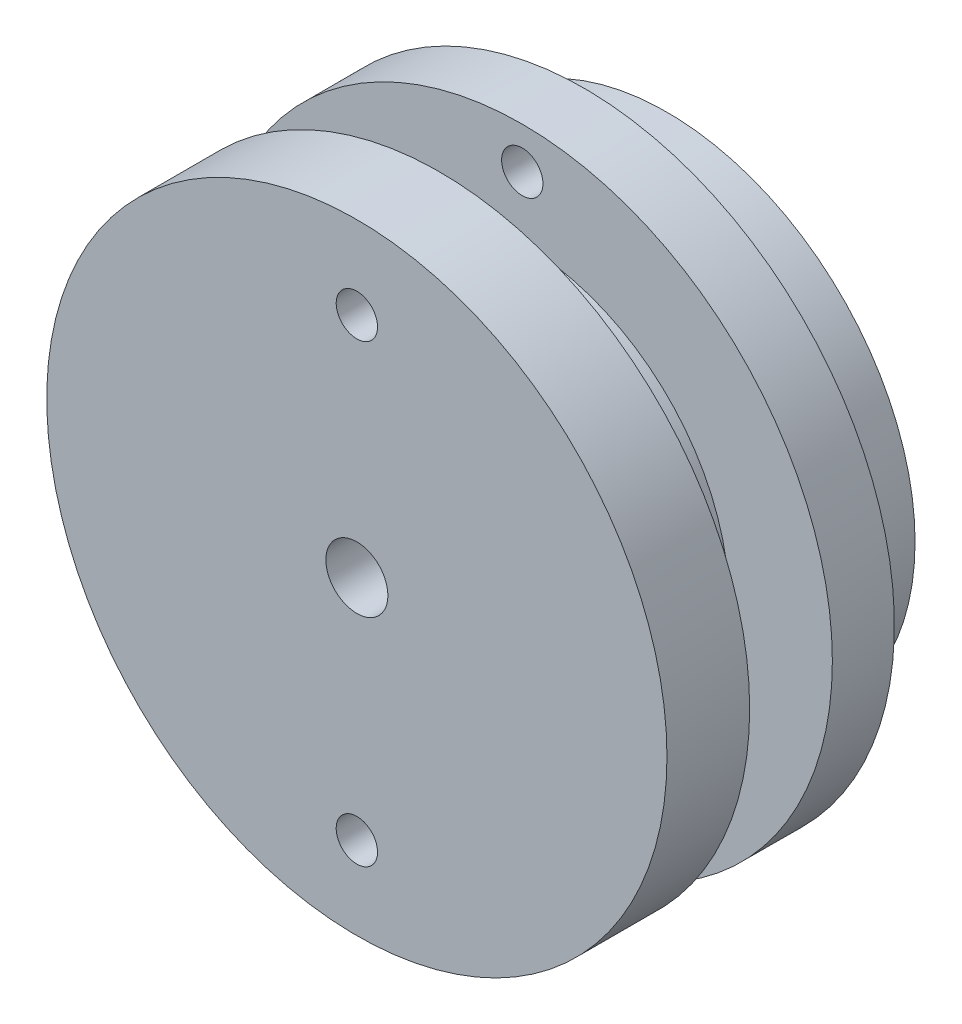
ISO-10303-21;
HEADER;
FILE_DESCRIPTION(('STEP AP214'),'2;1');
FILE_NAME('part.step','',(''),(''),'','','');
FILE_SCHEMA(('AUTOMOTIVE_DESIGN { 1 0 10303 214 1 1 1 1 }'));
ENDSEC;
DATA;
#1=APPLICATION_CONTEXT('core data for automotive mechanical design processes');
#2=APPLICATION_PROTOCOL_DEFINITION('international standard','automotive_design',2000,#1);
#3=PRODUCT_CONTEXT('',#1,'mechanical');
#4=PRODUCT('Part','Part','',(#3));
#5=PRODUCT_RELATED_PRODUCT_CATEGORY('part','',(#4));
#6=PRODUCT_DEFINITION_FORMATION('','',#4);
#7=PRODUCT_DEFINITION_CONTEXT('part definition',#1,'design');
#8=PRODUCT_DEFINITION('design','',#6,#7);
#9=PRODUCT_DEFINITION_SHAPE('','',#8);
#10=(LENGTH_UNIT() NAMED_UNIT(*) SI_UNIT(.MILLI.,.METRE.));
#11=(NAMED_UNIT(*) PLANE_ANGLE_UNIT() SI_UNIT($,.RADIAN.));
#12=(NAMED_UNIT(*) SI_UNIT($,.STERADIAN.) SOLID_ANGLE_UNIT());
#13=UNCERTAINTY_MEASURE_WITH_UNIT(LENGTH_MEASURE(1.E-05),#10,'distance_accuracy_value','');
#14=(GEOMETRIC_REPRESENTATION_CONTEXT(3) GLOBAL_UNCERTAINTY_ASSIGNED_CONTEXT((#13)) GLOBAL_UNIT_ASSIGNED_CONTEXT((#10,
#11,#12)) REPRESENTATION_CONTEXT('',''));
#15=CARTESIAN_POINT('',(0.,0.,0.));
#16=DIRECTION('',(0.,0.,1.));
#17=DIRECTION('',(1.,0.,0.));
#18=AXIS2_PLACEMENT_3D('',#15,#16,#17);
#19=CARTESIAN_POINT('',(0.,0.,0.));
#20=DIRECTION('',(0.,0.,1.));
#21=DIRECTION('',(1.,0.,0.));
#22=AXIS2_PLACEMENT_3D('',#19,#20,#21);
#23=PLANE('',#22);
#24=CARTESIAN_POINT('',(-7.75,0.,0.));
#25=DIRECTION('',(0.,0.,1.));
#26=DIRECTION('',(1.,0.,0.));
#27=AXIS2_PLACEMENT_3D('',#24,#25,#26);
#28=CIRCLE('',#27,1.2);
#29=CARTESIAN_POINT('',(-6.55,0.,0.));
#30=VERTEX_POINT('',#29);
#31=EDGE_CURVE('E241',#30,#30,#28,.T.);
#32=ORIENTED_EDGE('',*,*,#31,.T.);
#33=EDGE_LOOP('',(#32));
#34=FACE_BOUND('',#33,.T.);
#35=CARTESIAN_POINT('',(7.75,0.,0.));
#36=DIRECTION('',(0.,0.,1.));
#37=DIRECTION('',(1.,0.,0.));
#38=AXIS2_PLACEMENT_3D('',#35,#36,#37);
#39=CIRCLE('',#38,1.2);
#40=CARTESIAN_POINT('',(8.95,0.,0.));
#41=VERTEX_POINT('',#40);
#42=EDGE_CURVE('E251',#41,#41,#39,.T.);
#43=ORIENTED_EDGE('',*,*,#42,.T.);
#44=EDGE_LOOP('',(#43));
#45=FACE_BOUND('',#44,.T.);
#46=DIRECTION('',(1.,0.,0.));
#47=VECTOR('',#46,1.);
#48=CARTESIAN_POINT('',(4.65,-4.65,0.));
#49=LINE('',#48,#47);
#50=CARTESIAN_POINT('',(-4.65,-4.65,0.));
#51=VERTEX_POINT('',#50);
#52=CARTESIAN_POINT('',(4.65,-4.65,0.));
#53=VERTEX_POINT('',#52);
#54=EDGE_CURVE('E175',#51,#53,#49,.T.);
#55=ORIENTED_EDGE('',*,*,#54,.T.);
#56=DIRECTION('',(0.,1.,0.));
#57=VECTOR('',#56,1.);
#58=CARTESIAN_POINT('',(4.65,4.65,0.));
#59=LINE('',#58,#57);
#60=CARTESIAN_POINT('',(4.65,4.65,0.));
#61=VERTEX_POINT('',#60);
#62=EDGE_CURVE('E178',#53,#61,#59,.T.);
#63=ORIENTED_EDGE('',*,*,#62,.T.);
#64=DIRECTION('',(-1.,0.,0.));
#65=VECTOR('',#64,1.);
#66=CARTESIAN_POINT('',(-4.65,4.65,0.));
#67=LINE('',#66,#65);
#68=CARTESIAN_POINT('',(-4.65,4.65,0.));
#69=VERTEX_POINT('',#68);
#70=EDGE_CURVE('E182',#61,#69,#67,.T.);
#71=ORIENTED_EDGE('',*,*,#70,.T.);
#72=DIRECTION('',(0.,-1.,0.));
#73=VECTOR('',#72,1.);
#74=CARTESIAN_POINT('',(-4.65,-4.65,0.));
#75=LINE('',#74,#73);
#76=EDGE_CURVE('E185',#69,#51,#75,.T.);
#77=ORIENTED_EDGE('',*,*,#76,.T.);
#78=EDGE_LOOP('',(#55,#63,#71,#77));
#79=FACE_BOUND('',#78,.T.);
#80=CARTESIAN_POINT('',(0.,7.75,0.));
#81=DIRECTION('',(0.,0.,1.));
#82=DIRECTION('',(1.,0.,0.));
#83=AXIS2_PLACEMENT_3D('',#80,#81,#82);
#84=CIRCLE('',#83,1.2);
#85=CARTESIAN_POINT('',(1.2,7.75,0.));
#86=VERTEX_POINT('',#85);
#87=EDGE_CURVE('E179',#86,#86,#84,.T.);
#88=ORIENTED_EDGE('',*,*,#87,.T.);
#89=EDGE_LOOP('',(#88));
#90=FACE_BOUND('',#89,.T.);
#91=CARTESIAN_POINT('',(0.,-7.75,0.));
#92=DIRECTION('',(0.,0.,1.));
#93=DIRECTION('',(1.,0.,0.));
#94=AXIS2_PLACEMENT_3D('',#91,#92,#93);
#95=CIRCLE('',#94,1.2);
#96=CARTESIAN_POINT('',(1.2,-7.75,0.));
#97=VERTEX_POINT('',#96);
#98=EDGE_CURVE('E244',#97,#97,#95,.T.);
#99=ORIENTED_EDGE('',*,*,#98,.T.);
#100=EDGE_LOOP('',(#99));
#101=FACE_BOUND('',#100,.T.);
#102=CARTESIAN_POINT('',(0.,0.,0.));
#103=DIRECTION('',(0.,0.,-1.));
#104=DIRECTION('',(-1.,0.,0.));
#105=AXIS2_PLACEMENT_3D('',#102,#103,#104);
#106=CIRCLE('',#105,12.);
#107=CARTESIAN_POINT('',(-12.,0.,0.));
#108=VERTEX_POINT('',#107);
#109=EDGE_CURVE('E216',#108,#108,#106,.T.);
#110=ORIENTED_EDGE('',*,*,#109,.T.);
#111=EDGE_LOOP('',(#110));
#112=FACE_BOUND('',#111,.T.);
#113=ADVANCED_FACE('F33',(#34,#45,#79,#90,#101,#112),#23,.F.);
#114=CARTESIAN_POINT('',(0.,0.,7.));
#115=DIRECTION('',(0.,0.,-1.));
#116=DIRECTION('',(-1.,0.,0.));
#117=AXIS2_PLACEMENT_3D('',#114,#115,#116);
#118=CYLINDRICAL_SURFACE('',#117,15.);
#119=CARTESIAN_POINT('',(0.,0.,7.));
#120=DIRECTION('',(0.,0.,1.));
#121=DIRECTION('',(1.,0.,0.));
#122=AXIS2_PLACEMENT_3D('',#119,#120,#121);
#123=CIRCLE('',#122,15.);
#124=CARTESIAN_POINT('',(15.,0.,7.));
#125=VERTEX_POINT('',#124);
#126=EDGE_CURVE('E42',#125,#125,#123,.T.);
#127=ORIENTED_EDGE('',*,*,#126,.F.);
#128=EDGE_LOOP('',(#127));
#129=FACE_BOUND('',#128,.T.);
#130=CARTESIAN_POINT('',(0.,0.,4.));
#131=DIRECTION('',(0.,0.,-1.));
#132=DIRECTION('',(-1.,0.,0.));
#133=AXIS2_PLACEMENT_3D('',#130,#131,#132);
#134=CIRCLE('',#133,15.);
#135=CARTESIAN_POINT('',(-15.,0.,4.));
#136=VERTEX_POINT('',#135);
#137=EDGE_CURVE('E204',#136,#136,#134,.T.);
#138=ORIENTED_EDGE('',*,*,#137,.F.);
#139=EDGE_LOOP('',(#138));
#140=FACE_BOUND('',#139,.T.);
#141=ADVANCED_FACE('F35',(#129,#140),#118,.T.);
#142=CARTESIAN_POINT('',(0.,0.,7.));
#143=DIRECTION('',(0.,0.,1.));
#144=DIRECTION('',(1.,0.,0.));
#145=AXIS2_PLACEMENT_3D('',#142,#143,#144);
#146=PLANE('',#145);
#147=CARTESIAN_POINT('',(0.,13.,7.));
#148=DIRECTION('',(0.,0.,1.));
#149=DIRECTION('',(1.,0.,0.));
#150=AXIS2_PLACEMENT_3D('',#147,#148,#149);
#151=CIRCLE('',#150,0.999999999999999);
#152=CARTESIAN_POINT('',(0.999999999999999,13.,7.));
#153=VERTEX_POINT('',#152);
#154=EDGE_CURVE('E380',#153,#153,#151,.F.);
#155=ORIENTED_EDGE('',*,*,#154,.T.);
#156=EDGE_LOOP('',(#155));
#157=FACE_BOUND('',#156,.T.);
#158=CARTESIAN_POINT('',(0.,-13.,7.));
#159=DIRECTION('',(0.,0.,1.));
#160=DIRECTION('',(1.,0.,0.));
#161=AXIS2_PLACEMENT_3D('',#158,#159,#160);
#162=CIRCLE('',#161,0.999999999999999);
#163=CARTESIAN_POINT('',(0.999999999999999,-13.,7.));
#164=VERTEX_POINT('',#163);
#165=EDGE_CURVE('E373',#164,#164,#162,.F.);
#166=ORIENTED_EDGE('',*,*,#165,.T.);
#167=EDGE_LOOP('',(#166));
#168=FACE_BOUND('',#167,.T.);
#169=CARTESIAN_POINT('',(0.,0.,7.));
#170=DIRECTION('',(0.,0.,1.));
#171=DIRECTION('',(1.,0.,0.));
#172=AXIS2_PLACEMENT_3D('',#169,#170,#171);
#173=CIRCLE('',#172,10.);
#174=CARTESIAN_POINT('',(10.,0.,7.));
#175=VERTEX_POINT('',#174);
#176=EDGE_CURVE('E11',#175,#175,#173,.T.);
#177=ORIENTED_EDGE('',*,*,#176,.F.);
#178=EDGE_LOOP('',(#177));
#179=FACE_BOUND('',#178,.T.);
#180=ORIENTED_EDGE('',*,*,#126,.T.);
#181=EDGE_LOOP('',(#180));
#182=FACE_BOUND('',#181,.T.);
#183=ADVANCED_FACE('F198',(#157,#168,#179,#182),#146,.T.);
#184=CARTESIAN_POINT('',(4.65,-4.65,7.));
#185=DIRECTION('',(0.,1.,0.));
#186=DIRECTION('',(-1.,0.,0.));
#187=AXIS2_PLACEMENT_3D('',#184,#185,#186);
#188=PLANE('',#187);
#189=ORIENTED_EDGE('',*,*,#54,.F.);
#190=DIRECTION('',(0.,0.,-1.));
#191=VECTOR('',#190,1.);
#192=CARTESIAN_POINT('',(-4.65,-4.65,7.));
#193=LINE('',#192,#191);
#194=CARTESIAN_POINT('',(-4.65,-4.65,11.));
#195=VERTEX_POINT('',#194);
#196=EDGE_CURVE('E129',#195,#51,#193,.T.);
#197=ORIENTED_EDGE('',*,*,#196,.F.);
#198=DIRECTION('',(1.,0.,0.));
#199=VECTOR('',#198,1.);
#200=CARTESIAN_POINT('',(-3.3,-4.65,11.));
#201=LINE('',#200,#199);
#202=CARTESIAN_POINT('',(-3.3,-4.65,11.));
#203=VERTEX_POINT('',#202);
#204=EDGE_CURVE('E114',#195,#203,#201,.T.);
#205=ORIENTED_EDGE('',*,*,#204,.T.);
#206=DIRECTION('',(0.,0.,-1.));
#207=VECTOR('',#206,1.);
#208=CARTESIAN_POINT('',(-3.3,-4.65,11.));
#209=LINE('',#208,#207);
#210=CARTESIAN_POINT('',(-3.3,-4.65,7.));
#211=VERTEX_POINT('',#210);
#212=EDGE_CURVE('E126',#203,#211,#209,.T.);
#213=ORIENTED_EDGE('',*,*,#212,.T.);
#214=DIRECTION('',(1.,0.,0.));
#215=VECTOR('',#214,1.);
#216=CARTESIAN_POINT('',(4.65,-4.65,7.));
#217=LINE('',#216,#215);
#218=CARTESIAN_POINT('',(3.3,-4.65,7.));
#219=VERTEX_POINT('',#218);
#220=EDGE_CURVE('E168',#211,#219,#217,.T.);
#221=ORIENTED_EDGE('',*,*,#220,.T.);
#222=DIRECTION('',(0.,0.,-1.));
#223=VECTOR('',#222,1.);
#224=CARTESIAN_POINT('',(3.3,-4.65,11.));
#225=LINE('',#224,#223);
#226=CARTESIAN_POINT('',(3.3,-4.65,11.));
#227=VERTEX_POINT('',#226);
#228=EDGE_CURVE('E143',#227,#219,#225,.T.);
#229=ORIENTED_EDGE('',*,*,#228,.F.);
#230=DIRECTION('',(1.,0.,0.));
#231=VECTOR('',#230,1.);
#232=CARTESIAN_POINT('',(3.3,-4.65,11.));
#233=LINE('',#232,#231);
#234=CARTESIAN_POINT('',(4.65,-4.65,11.));
#235=VERTEX_POINT('',#234);
#236=EDGE_CURVE('E152',#227,#235,#233,.T.);
#237=ORIENTED_EDGE('',*,*,#236,.T.);
#238=DIRECTION('',(0.,0.,-1.));
#239=VECTOR('',#238,1.);
#240=CARTESIAN_POINT('',(4.65,-4.65,7.));
#241=LINE('',#240,#239);
#242=EDGE_CURVE('E193',#235,#53,#241,.T.);
#243=ORIENTED_EDGE('',*,*,#242,.T.);
#244=EDGE_LOOP('',(#189,#197,#205,#213,#221,#229,#237,#243));
#245=FACE_BOUND('',#244,.T.);
#246=ADVANCED_FACE('F124',(#245),#188,.T.);
#247=CARTESIAN_POINT('',(4.65,4.65,7.));
#248=DIRECTION('',(-1.,0.,0.));
#249=DIRECTION('',(0.,-1.,0.));
#250=AXIS2_PLACEMENT_3D('',#247,#248,#249);
#251=PLANE('',#250);
#252=ORIENTED_EDGE('',*,*,#62,.F.);
#253=ORIENTED_EDGE('',*,*,#242,.F.);
#254=DIRECTION('',(0.,1.,0.));
#255=VECTOR('',#254,1.);
#256=CARTESIAN_POINT('',(4.65,-4.65,11.));
#257=LINE('',#256,#255);
#258=CARTESIAN_POINT('',(4.65,4.65,11.));
#259=VERTEX_POINT('',#258);
#260=EDGE_CURVE('E224',#235,#259,#257,.T.);
#261=ORIENTED_EDGE('',*,*,#260,.T.);
#262=DIRECTION('',(0.,0.,-1.));
#263=VECTOR('',#262,1.);
#264=CARTESIAN_POINT('',(4.65,4.65,7.));
#265=LINE('',#264,#263);
#266=EDGE_CURVE('E191',#259,#61,#265,.T.);
#267=ORIENTED_EDGE('',*,*,#266,.T.);
#268=EDGE_LOOP('',(#252,#253,#261,#267));
#269=FACE_BOUND('',#268,.T.);
#270=ADVANCED_FACE('F289',(#269),#251,.T.);
#271=CARTESIAN_POINT('',(-4.65,4.65,7.));
#272=DIRECTION('',(0.,-1.,0.));
#273=DIRECTION('',(0.,0.,-1.));
#274=AXIS2_PLACEMENT_3D('',#271,#272,#273);
#275=PLANE('',#274);
#276=ORIENTED_EDGE('',*,*,#70,.F.);
#277=ORIENTED_EDGE('',*,*,#266,.F.);
#278=DIRECTION('',(-1.,0.,0.));
#279=VECTOR('',#278,1.);
#280=CARTESIAN_POINT('',(4.65,4.65,11.));
#281=LINE('',#280,#279);
#282=CARTESIAN_POINT('',(3.3,4.65,11.));
#283=VERTEX_POINT('',#282);
#284=EDGE_CURVE('E227',#259,#283,#281,.T.);
#285=ORIENTED_EDGE('',*,*,#284,.T.);
#286=DIRECTION('',(0.,0.,-1.));
#287=VECTOR('',#286,1.);
#288=CARTESIAN_POINT('',(3.3,4.65,11.));
#289=LINE('',#288,#287);
#290=CARTESIAN_POINT('',(3.3,4.65,7.));
#291=VERTEX_POINT('',#290);
#292=EDGE_CURVE('E145',#283,#291,#289,.T.);
#293=ORIENTED_EDGE('',*,*,#292,.T.);
#294=DIRECTION('',(-1.,0.,0.));
#295=VECTOR('',#294,1.);
#296=CARTESIAN_POINT('',(-4.65,4.65,7.));
#297=LINE('',#296,#295);
#298=CARTESIAN_POINT('',(-3.3,4.65,7.));
#299=VERTEX_POINT('',#298);
#300=EDGE_CURVE('E164',#291,#299,#297,.T.);
#301=ORIENTED_EDGE('',*,*,#300,.T.);
#302=DIRECTION('',(0.,0.,-1.));
#303=VECTOR('',#302,1.);
#304=CARTESIAN_POINT('',(-3.3,4.65,11.));
#305=LINE('',#304,#303);
#306=CARTESIAN_POINT('',(-3.3,4.65,11.));
#307=VERTEX_POINT('',#306);
#308=EDGE_CURVE('E136',#307,#299,#305,.T.);
#309=ORIENTED_EDGE('',*,*,#308,.F.);
#310=DIRECTION('',(-1.,0.,0.));
#311=VECTOR('',#310,1.);
#312=CARTESIAN_POINT('',(-4.65,4.65,11.));
#313=LINE('',#312,#311);
#314=CARTESIAN_POINT('',(-4.65,4.65,11.));
#315=VERTEX_POINT('',#314);
#316=EDGE_CURVE('E117',#307,#315,#313,.T.);
#317=ORIENTED_EDGE('',*,*,#316,.T.);
#318=DIRECTION('',(0.,0.,-1.));
#319=VECTOR('',#318,1.);
#320=CARTESIAN_POINT('',(-4.65,4.65,7.));
#321=LINE('',#320,#319);
#322=EDGE_CURVE('E189',#315,#69,#321,.T.);
#323=ORIENTED_EDGE('',*,*,#322,.T.);
#324=EDGE_LOOP('',(#276,#277,#285,#293,#301,#309,#317,#323));
#325=FACE_BOUND('',#324,.T.);
#326=ADVANCED_FACE('F275',(#325),#275,.T.);
#327=CARTESIAN_POINT('',(-4.65,-4.65,7.));
#328=DIRECTION('',(1.,0.,0.));
#329=DIRECTION('',(0.,0.,-1.));
#330=AXIS2_PLACEMENT_3D('',#327,#328,#329);
#331=PLANE('',#330);
#332=ORIENTED_EDGE('',*,*,#76,.F.);
#333=ORIENTED_EDGE('',*,*,#322,.F.);
#334=DIRECTION('',(0.,-1.,0.));
#335=VECTOR('',#334,1.);
#336=CARTESIAN_POINT('',(-4.65,-4.65,11.));
#337=LINE('',#336,#335);
#338=EDGE_CURVE('E131',#315,#195,#337,.T.);
#339=ORIENTED_EDGE('',*,*,#338,.T.);
#340=ORIENTED_EDGE('',*,*,#196,.T.);
#341=EDGE_LOOP('',(#332,#333,#339,#340));
#342=FACE_BOUND('',#341,.T.);
#343=ADVANCED_FACE('F265',(#342),#331,.T.);
#344=CARTESIAN_POINT('',(0.,7.75,7.));
#345=DIRECTION('',(0.,0.,-1.));
#346=DIRECTION('',(-1.,0.,0.));
#347=AXIS2_PLACEMENT_3D('',#344,#345,#346);
#348=CYLINDRICAL_SURFACE('',#347,1.2);
#349=CARTESIAN_POINT('',(0.,7.75,7.));
#350=DIRECTION('',(0.,0.,1.));
#351=DIRECTION('',(1.,0.,0.));
#352=AXIS2_PLACEMENT_3D('',#349,#350,#351);
#353=CIRCLE('',#352,1.2);
#354=CARTESIAN_POINT('',(1.2,7.75,7.));
#355=VERTEX_POINT('',#354);
#356=EDGE_CURVE('E248',#355,#355,#353,.T.);
#357=ORIENTED_EDGE('',*,*,#356,.T.);
#358=EDGE_LOOP('',(#357));
#359=FACE_BOUND('',#358,.T.);
#360=ORIENTED_EDGE('',*,*,#87,.F.);
#361=EDGE_LOOP('',(#360));
#362=FACE_BOUND('',#361,.T.);
#363=ADVANCED_FACE('F262',(#359,#362),#348,.F.);
#364=CARTESIAN_POINT('',(7.75,0.,7.));
#365=DIRECTION('',(0.,0.,-1.));
#366=DIRECTION('',(-1.,0.,0.));
#367=AXIS2_PLACEMENT_3D('',#364,#365,#366);
#368=CYLINDRICAL_SURFACE('',#367,1.2);
#369=CARTESIAN_POINT('',(7.75,0.,7.));
#370=DIRECTION('',(0.,0.,1.));
#371=DIRECTION('',(1.,0.,0.));
#372=AXIS2_PLACEMENT_3D('',#369,#370,#371);
#373=CIRCLE('',#372,1.2);
#374=CARTESIAN_POINT('',(8.95,0.,7.));
#375=VERTEX_POINT('',#374);
#376=EDGE_CURVE('E240',#375,#375,#373,.T.);
#377=ORIENTED_EDGE('',*,*,#376,.T.);
#378=EDGE_LOOP('',(#377));
#379=FACE_BOUND('',#378,.T.);
#380=ORIENTED_EDGE('',*,*,#42,.F.);
#381=EDGE_LOOP('',(#380));
#382=FACE_BOUND('',#381,.T.);
#383=ADVANCED_FACE('F264',(#379,#382),#368,.F.);
#384=CARTESIAN_POINT('',(0.,-7.75,7.));
#385=DIRECTION('',(0.,0.,-1.));
#386=DIRECTION('',(-1.,0.,0.));
#387=AXIS2_PLACEMENT_3D('',#384,#385,#386);
#388=CYLINDRICAL_SURFACE('',#387,1.2);
#389=CARTESIAN_POINT('',(0.,-7.75,7.));
#390=DIRECTION('',(0.,0.,1.));
#391=DIRECTION('',(1.,0.,0.));
#392=AXIS2_PLACEMENT_3D('',#389,#390,#391);
#393=CIRCLE('',#392,1.2);
#394=CARTESIAN_POINT('',(1.2,-7.75,7.));
#395=VERTEX_POINT('',#394);
#396=EDGE_CURVE('E245',#395,#395,#393,.T.);
#397=ORIENTED_EDGE('',*,*,#396,.T.);
#398=EDGE_LOOP('',(#397));
#399=FACE_BOUND('',#398,.T.);
#400=ORIENTED_EDGE('',*,*,#98,.F.);
#401=EDGE_LOOP('',(#400));
#402=FACE_BOUND('',#401,.T.);
#403=ADVANCED_FACE('F272',(#399,#402),#388,.F.);
#404=CARTESIAN_POINT('',(-7.75,0.,7.));
#405=DIRECTION('',(0.,0.,-1.));
#406=DIRECTION('',(-1.,0.,0.));
#407=AXIS2_PLACEMENT_3D('',#404,#405,#406);
#408=CYLINDRICAL_SURFACE('',#407,1.2);
#409=CARTESIAN_POINT('',(-7.75,0.,7.));
#410=DIRECTION('',(0.,0.,1.));
#411=DIRECTION('',(1.,0.,0.));
#412=AXIS2_PLACEMENT_3D('',#409,#410,#411);
#413=CIRCLE('',#412,1.2);
#414=CARTESIAN_POINT('',(-6.55,0.,7.));
#415=VERTEX_POINT('',#414);
#416=EDGE_CURVE('E236',#415,#415,#413,.T.);
#417=ORIENTED_EDGE('',*,*,#416,.T.);
#418=EDGE_LOOP('',(#417));
#419=FACE_BOUND('',#418,.T.);
#420=ORIENTED_EDGE('',*,*,#31,.F.);
#421=EDGE_LOOP('',(#420));
#422=FACE_BOUND('',#421,.T.);
#423=ADVANCED_FACE('F350',(#419,#422),#408,.F.);
#424=CARTESIAN_POINT('',(3.3,4.65,11.));
#425=DIRECTION('',(1.,0.,0.));
#426=DIRECTION('',(0.,1.,0.));
#427=AXIS2_PLACEMENT_3D('',#424,#425,#426);
#428=PLANE('',#427);
#429=DIRECTION('',(0.,-1.,0.));
#430=VECTOR('',#429,1.);
#431=CARTESIAN_POINT('',(3.3,4.65,7.));
#432=LINE('',#431,#430);
#433=EDGE_CURVE('E149',#291,#219,#432,.T.);
#434=ORIENTED_EDGE('',*,*,#433,.F.);
#435=ORIENTED_EDGE('',*,*,#292,.F.);
#436=DIRECTION('',(0.,-1.,0.));
#437=VECTOR('',#436,1.);
#438=CARTESIAN_POINT('',(3.3,4.65,11.));
#439=LINE('',#438,#437);
#440=EDGE_CURVE('E146',#283,#227,#439,.T.);
#441=ORIENTED_EDGE('',*,*,#440,.T.);
#442=ORIENTED_EDGE('',*,*,#228,.T.);
#443=EDGE_LOOP('',(#434,#435,#441,#442));
#444=FACE_BOUND('',#443,.T.);
#445=ADVANCED_FACE('F309',(#444),#428,.T.);
#446=CARTESIAN_POINT('',(0.,0.,11.));
#447=DIRECTION('',(0.,0.,-1.));
#448=DIRECTION('',(-1.,0.,0.));
#449=AXIS2_PLACEMENT_3D('',#446,#447,#448);
#450=CYLINDRICAL_SURFACE('',#449,1.5);
#451=CARTESIAN_POINT('',(0.,0.,7.));
#452=DIRECTION('',(0.,0.,1.));
#453=DIRECTION('',(1.,0.,0.));
#454=AXIS2_PLACEMENT_3D('',#451,#452,#453);
#455=CIRCLE('',#454,1.5);
#456=CARTESIAN_POINT('',(1.5,0.,7.));
#457=VERTEX_POINT('',#456);
#458=EDGE_CURVE('E158',#457,#457,#455,.T.);
#459=ORIENTED_EDGE('',*,*,#458,.F.);
#460=EDGE_LOOP('',(#459));
#461=FACE_BOUND('',#460,.T.);
#462=CARTESIAN_POINT('',(0.,0.,15.));
#463=DIRECTION('',(0.,0.,1.));
#464=DIRECTION('',(1.,0.,0.));
#465=AXIS2_PLACEMENT_3D('',#462,#463,#464);
#466=CIRCLE('',#465,1.5);
#467=CARTESIAN_POINT('',(1.5,0.,15.));
#468=VERTEX_POINT('',#467);
#469=EDGE_CURVE('E206',#468,#468,#466,.T.);
#470=ORIENTED_EDGE('',*,*,#469,.T.);
#471=EDGE_LOOP('',(#470));
#472=FACE_BOUND('',#471,.T.);
#473=ADVANCED_FACE('F321',(#461,#472),#450,.F.);
#474=CARTESIAN_POINT('',(-3.3,4.65,11.));
#475=DIRECTION('',(-1.,0.,0.));
#476=DIRECTION('',(0.,0.,1.));
#477=AXIS2_PLACEMENT_3D('',#474,#475,#476);
#478=PLANE('',#477);
#479=DIRECTION('',(0.,1.,0.));
#480=VECTOR('',#479,1.);
#481=CARTESIAN_POINT('',(-3.3,4.65,7.));
#482=LINE('',#481,#480);
#483=EDGE_CURVE('E135',#211,#299,#482,.T.);
#484=ORIENTED_EDGE('',*,*,#483,.F.);
#485=ORIENTED_EDGE('',*,*,#212,.F.);
#486=DIRECTION('',(0.,1.,0.));
#487=VECTOR('',#486,1.);
#488=CARTESIAN_POINT('',(-3.3,4.65,11.));
#489=LINE('',#488,#487);
#490=EDGE_CURVE('E111',#203,#307,#489,.T.);
#491=ORIENTED_EDGE('',*,*,#490,.T.);
#492=ORIENTED_EDGE('',*,*,#308,.T.);
#493=EDGE_LOOP('',(#484,#485,#491,#492));
#494=FACE_BOUND('',#493,.T.);
#495=ADVANCED_FACE('F133',(#494),#478,.T.);
#496=CARTESIAN_POINT('',(0.,0.,11.));
#497=DIRECTION('',(0.,0.,-1.));
#498=DIRECTION('',(-1.,0.,0.));
#499=AXIS2_PLACEMENT_3D('',#496,#497,#498);
#500=CYLINDRICAL_SURFACE('',#499,10.);
#501=CARTESIAN_POINT('',(0.,0.,11.));
#502=DIRECTION('',(0.,0.,1.));
#503=DIRECTION('',(1.,0.,0.));
#504=AXIS2_PLACEMENT_3D('',#501,#502,#503);
#505=CIRCLE('',#504,10.);
#506=CARTESIAN_POINT('',(0.,10.,11.));
#507=VERTEX_POINT('',#506);
#508=CARTESIAN_POINT('',(0.,-10.,11.));
#509=VERTEX_POINT('',#508);
#510=EDGE_CURVE('E137',#507,#509,#505,.T.);
#511=ORIENTED_EDGE('',*,*,#510,.F.);
#512=EDGE_CURVE('E54',#509,#507,#505,.T.);
#513=ORIENTED_EDGE('',*,*,#512,.F.);
#514=EDGE_LOOP('',(#511,#513));
#515=FACE_BOUND('',#514,.T.);
#516=ORIENTED_EDGE('',*,*,#176,.T.);
#517=EDGE_LOOP('',(#516));
#518=FACE_BOUND('',#517,.T.);
#519=ADVANCED_FACE('F315',(#515,#518),#500,.T.);
#520=CARTESIAN_POINT('',(0.,0.,7.));
#521=DIRECTION('',(0.,0.,1.));
#522=DIRECTION('',(1.,0.,0.));
#523=AXIS2_PLACEMENT_3D('',#520,#521,#522);
#524=PLANE('',#523);
#525=ORIENTED_EDGE('',*,*,#220,.F.);
#526=ORIENTED_EDGE('',*,*,#483,.T.);
#527=ORIENTED_EDGE('',*,*,#300,.F.);
#528=ORIENTED_EDGE('',*,*,#433,.T.);
#529=EDGE_LOOP('',(#525,#526,#527,#528));
#530=FACE_BOUND('',#529,.T.);
#531=ORIENTED_EDGE('',*,*,#458,.T.);
#532=EDGE_LOOP('',(#531));
#533=FACE_BOUND('',#532,.T.);
#534=ADVANCED_FACE('F311',(#530,#533),#524,.F.);
#535=ORIENTED_EDGE('',*,*,#416,.F.);
#536=EDGE_LOOP('',(#535));
#537=FACE_BOUND('',#536,.T.);
#538=ADVANCED_FACE('F314',(#537),#524,.F.);
#539=ORIENTED_EDGE('',*,*,#376,.F.);
#540=EDGE_LOOP('',(#539));
#541=FACE_BOUND('',#540,.T.);
#542=ADVANCED_FACE('F317',(#541),#524,.F.);
#543=ORIENTED_EDGE('',*,*,#356,.F.);
#544=EDGE_LOOP('',(#543));
#545=FACE_BOUND('',#544,.T.);
#546=ADVANCED_FACE('F318',(#545),#524,.F.);
#547=ORIENTED_EDGE('',*,*,#396,.F.);
#548=EDGE_LOOP('',(#547));
#549=FACE_BOUND('',#548,.T.);
#550=ADVANCED_FACE('F339',(#549),#524,.F.);
#551=CARTESIAN_POINT('',(0.,0.,15.));
#552=DIRECTION('',(0.,0.,-1.));
#553=DIRECTION('',(-1.,0.,0.));
#554=AXIS2_PLACEMENT_3D('',#551,#552,#553);
#555=CYLINDRICAL_SURFACE('',#554,15.);
#556=CARTESIAN_POINT('',(0.,0.,15.));
#557=DIRECTION('',(0.,0.,1.));
#558=DIRECTION('',(1.,0.,0.));
#559=AXIS2_PLACEMENT_3D('',#556,#557,#558);
#560=CIRCLE('',#559,15.);
#561=CARTESIAN_POINT('',(15.,0.,15.));
#562=VERTEX_POINT('',#561);
#563=EDGE_CURVE('E153',#562,#562,#560,.T.);
#564=ORIENTED_EDGE('',*,*,#563,.F.);
#565=EDGE_LOOP('',(#564));
#566=FACE_BOUND('',#565,.T.);
#567=CARTESIAN_POINT('',(0.,0.,11.));
#568=DIRECTION('',(0.,0.,1.));
#569=DIRECTION('',(1.,0.,0.));
#570=AXIS2_PLACEMENT_3D('',#567,#568,#569);
#571=CIRCLE('',#570,15.);
#572=CARTESIAN_POINT('',(15.,0.,11.));
#573=VERTEX_POINT('',#572);
#574=EDGE_CURVE('E210',#573,#573,#571,.T.);
#575=ORIENTED_EDGE('',*,*,#574,.T.);
#576=EDGE_LOOP('',(#575));
#577=FACE_BOUND('',#576,.T.);
#578=ADVANCED_FACE('F330',(#566,#577),#555,.T.);
#579=CARTESIAN_POINT('',(0.,0.,15.));
#580=DIRECTION('',(0.,0.,1.));
#581=DIRECTION('',(1.,0.,0.));
#582=AXIS2_PLACEMENT_3D('',#579,#580,#581);
#583=PLANE('',#582);
#584=CARTESIAN_POINT('',(0.,-11.,15.));
#585=DIRECTION('',(0.,0.,-1.));
#586=DIRECTION('',(1.,0.,0.));
#587=AXIS2_PLACEMENT_3D('',#584,#585,#586);
#588=CIRCLE('',#587,1.);
#589=CARTESIAN_POINT('',(1.,-11.,15.));
#590=VERTEX_POINT('',#589);
#591=EDGE_CURVE('E390',#590,#590,#588,.T.);
#592=ORIENTED_EDGE('',*,*,#591,.T.);
#593=EDGE_LOOP('',(#592));
#594=FACE_BOUND('',#593,.T.);
#595=CARTESIAN_POINT('',(0.,11.,15.));
#596=DIRECTION('',(0.,0.,-1.));
#597=DIRECTION('',(-1.,0.,0.));
#598=AXIS2_PLACEMENT_3D('',#595,#596,#597);
#599=CIRCLE('',#598,1.);
#600=CARTESIAN_POINT('',(-1.,11.,15.));
#601=VERTEX_POINT('',#600);
#602=EDGE_CURVE('E387',#601,#601,#599,.T.);
#603=ORIENTED_EDGE('',*,*,#602,.T.);
#604=EDGE_LOOP('',(#603));
#605=FACE_BOUND('',#604,.T.);
#606=ORIENTED_EDGE('',*,*,#563,.T.);
#607=EDGE_LOOP('',(#606));
#608=FACE_BOUND('',#607,.T.);
#609=ORIENTED_EDGE('',*,*,#469,.F.);
#610=EDGE_LOOP('',(#609));
#611=FACE_BOUND('',#610,.T.);
#612=ADVANCED_FACE('F327',(#594,#605,#608,#611),#583,.T.);
#613=CARTESIAN_POINT('',(0.,0.,11.));
#614=DIRECTION('',(0.,0.,1.));
#615=DIRECTION('',(1.,0.,0.));
#616=AXIS2_PLACEMENT_3D('',#613,#614,#615);
#617=PLANE('',#616);
#618=ORIENTED_EDGE('',*,*,#574,.F.);
#619=EDGE_LOOP('',(#618));
#620=FACE_BOUND('',#619,.T.);
#621=ORIENTED_EDGE('',*,*,#510,.T.);
#622=CARTESIAN_POINT('',(0.,-11.,11.));
#623=DIRECTION('',(0.,0.,-1.));
#624=DIRECTION('',(1.,0.,0.));
#625=AXIS2_PLACEMENT_3D('',#622,#623,#624);
#626=CIRCLE('',#625,1.);
#627=EDGE_CURVE('E48',#509,#509,#626,.T.);
#628=ORIENTED_EDGE('',*,*,#627,.F.);
#629=ORIENTED_EDGE('',*,*,#512,.T.);
#630=CARTESIAN_POINT('',(0.,11.,11.));
#631=DIRECTION('',(0.,0.,-1.));
#632=DIRECTION('',(-1.,0.,0.));
#633=AXIS2_PLACEMENT_3D('',#630,#631,#632);
#634=CIRCLE('',#633,1.);
#635=EDGE_CURVE('E388',#507,#507,#634,.T.);
#636=ORIENTED_EDGE('',*,*,#635,.F.);
#637=EDGE_LOOP('',(#621,#628,#629,#636));
#638=FACE_BOUND('',#637,.T.);
#639=ADVANCED_FACE('F329',(#620,#638),#617,.F.);
#640=ORIENTED_EDGE('',*,*,#338,.F.);
#641=ORIENTED_EDGE('',*,*,#316,.F.);
#642=ORIENTED_EDGE('',*,*,#490,.F.);
#643=ORIENTED_EDGE('',*,*,#204,.F.);
#644=EDGE_LOOP('',(#640,#641,#642,#643));
#645=FACE_BOUND('',#644,.T.);
#646=ADVANCED_FACE('F113',(#645),#617,.F.);
#647=ORIENTED_EDGE('',*,*,#236,.F.);
#648=ORIENTED_EDGE('',*,*,#440,.F.);
#649=ORIENTED_EDGE('',*,*,#284,.F.);
#650=ORIENTED_EDGE('',*,*,#260,.F.);
#651=EDGE_LOOP('',(#647,#648,#649,#650));
#652=FACE_BOUND('',#651,.T.);
#653=ADVANCED_FACE('F305',(#652),#617,.F.);
#654=CARTESIAN_POINT('',(0.,0.,4.));
#655=DIRECTION('',(0.,0.,-1.));
#656=DIRECTION('',(-1.,0.,0.));
#657=AXIS2_PLACEMENT_3D('',#654,#655,#656);
#658=PLANE('',#657);
#659=CARTESIAN_POINT('',(0.,0.,4.));
#660=DIRECTION('',(0.,0.,-1.));
#661=DIRECTION('',(-1.,0.,0.));
#662=AXIS2_PLACEMENT_3D('',#659,#660,#661);
#663=CIRCLE('',#662,12.);
#664=CARTESIAN_POINT('',(0.,12.,4.));
#665=VERTEX_POINT('',#664);
#666=CARTESIAN_POINT('',(0.,-12.,4.));
#667=VERTEX_POINT('',#666);
#668=EDGE_CURVE('E213',#665,#667,#663,.T.);
#669=ORIENTED_EDGE('',*,*,#668,.F.);
#670=CARTESIAN_POINT('',(0.,13.,4.));
#671=DIRECTION('',(0.,0.,-1.));
#672=DIRECTION('',(-1.,0.,0.));
#673=AXIS2_PLACEMENT_3D('',#670,#671,#672);
#674=CIRCLE('',#673,0.999999999999999);
#675=EDGE_CURVE('E385',#665,#665,#674,.T.);
#676=ORIENTED_EDGE('',*,*,#675,.F.);
#677=EDGE_CURVE('E207',#667,#665,#663,.T.);
#678=ORIENTED_EDGE('',*,*,#677,.F.);
#679=CARTESIAN_POINT('',(0.,-13.,4.));
#680=DIRECTION('',(0.,0.,-1.));
#681=DIRECTION('',(1.,0.,0.));
#682=AXIS2_PLACEMENT_3D('',#679,#680,#681);
#683=CIRCLE('',#682,0.999999999999999);
#684=EDGE_CURVE('E375',#667,#667,#683,.T.);
#685=ORIENTED_EDGE('',*,*,#684,.F.);
#686=EDGE_LOOP('',(#669,#676,#678,#685));
#687=FACE_BOUND('',#686,.T.);
#688=ORIENTED_EDGE('',*,*,#137,.T.);
#689=EDGE_LOOP('',(#688));
#690=FACE_BOUND('',#689,.T.);
#691=ADVANCED_FACE('F345',(#687,#690),#658,.T.);
#692=CARTESIAN_POINT('',(0.,0.,4.));
#693=DIRECTION('',(0.,0.,-1.));
#694=DIRECTION('',(-1.,0.,0.));
#695=AXIS2_PLACEMENT_3D('',#692,#693,#694);
#696=CYLINDRICAL_SURFACE('',#695,12.);
#697=ORIENTED_EDGE('',*,*,#677,.T.);
#698=ORIENTED_EDGE('',*,*,#668,.T.);
#699=EDGE_LOOP('',(#697,#698));
#700=FACE_BOUND('',#699,.T.);
#701=ORIENTED_EDGE('',*,*,#109,.F.);
#702=EDGE_LOOP('',(#701));
#703=FACE_BOUND('',#702,.T.);
#704=ADVANCED_FACE('F412',(#700,#703),#696,.T.);
#705=CARTESIAN_POINT('',(0.,-13.,9.82842712474619));
#706=DIRECTION('',(0.,0.,-1.));
#707=DIRECTION('',(-1.,0.,0.));
#708=AXIS2_PLACEMENT_3D('',#705,#706,#707);
#709=CYLINDRICAL_SURFACE('',#708,0.999999999999999);
#710=ORIENTED_EDGE('',*,*,#684,.T.);
#711=EDGE_LOOP('',(#710));
#712=FACE_BOUND('',#711,.T.);
#713=ORIENTED_EDGE('',*,*,#165,.F.);
#714=EDGE_LOOP('',(#713));
#715=FACE_BOUND('',#714,.T.);
#716=ADVANCED_FACE('F409',(#712,#715),#709,.F.);
#717=CARTESIAN_POINT('',(0.,13.,9.82842712474619));
#718=DIRECTION('',(0.,0.,-1.));
#719=DIRECTION('',(-1.,0.,0.));
#720=AXIS2_PLACEMENT_3D('',#717,#718,#719);
#721=CYLINDRICAL_SURFACE('',#720,0.999999999999999);
#722=ORIENTED_EDGE('',*,*,#675,.T.);
#723=EDGE_LOOP('',(#722));
#724=FACE_BOUND('',#723,.T.);
#725=ORIENTED_EDGE('',*,*,#154,.F.);
#726=EDGE_LOOP('',(#725));
#727=FACE_BOUND('',#726,.T.);
#728=ADVANCED_FACE('F403',(#724,#727),#721,.F.);
#729=CARTESIAN_POINT('',(0.,11.,15.));
#730=DIRECTION('',(0.,0.,-1.));
#731=DIRECTION('',(-1.,0.,0.));
#732=AXIS2_PLACEMENT_3D('',#729,#730,#731);
#733=CYLINDRICAL_SURFACE('',#732,1.);
#734=ORIENTED_EDGE('',*,*,#602,.F.);
#735=EDGE_LOOP('',(#734));
#736=FACE_BOUND('',#735,.T.);
#737=ORIENTED_EDGE('',*,*,#635,.T.);
#738=EDGE_LOOP('',(#737));
#739=FACE_BOUND('',#738,.T.);
#740=ADVANCED_FACE('F398',(#736,#739),#733,.F.);
#741=CARTESIAN_POINT('',(0.,-11.,15.));
#742=DIRECTION('',(0.,0.,-1.));
#743=DIRECTION('',(-1.,0.,0.));
#744=AXIS2_PLACEMENT_3D('',#741,#742,#743);
#745=CYLINDRICAL_SURFACE('',#744,1.);
#746=ORIENTED_EDGE('',*,*,#591,.F.);
#747=EDGE_LOOP('',(#746));
#748=FACE_BOUND('',#747,.T.);
#749=ORIENTED_EDGE('',*,*,#627,.T.);
#750=EDGE_LOOP('',(#749));
#751=FACE_BOUND('',#750,.T.);
#752=ADVANCED_FACE('F396',(#748,#751),#745,.F.);
#753=CLOSED_SHELL('',(#113,#141,#183,#246,#270,#326,#343,#363,#383,#403,#423,#445,#473,#495,
#519,#534,#538,#542,#546,#550,#578,#612,#639,#646,#653,#691,#704,#716,#728,#740,#752));
#754=MANIFOLD_SOLID_BREP('B2',#753);
#755=ADVANCED_BREP_SHAPE_REPRESENTATION('',(#18,#754),#14);
#756=SHAPE_DEFINITION_REPRESENTATION(#9,#755);
ENDSEC;
END-ISO-10303-21;
